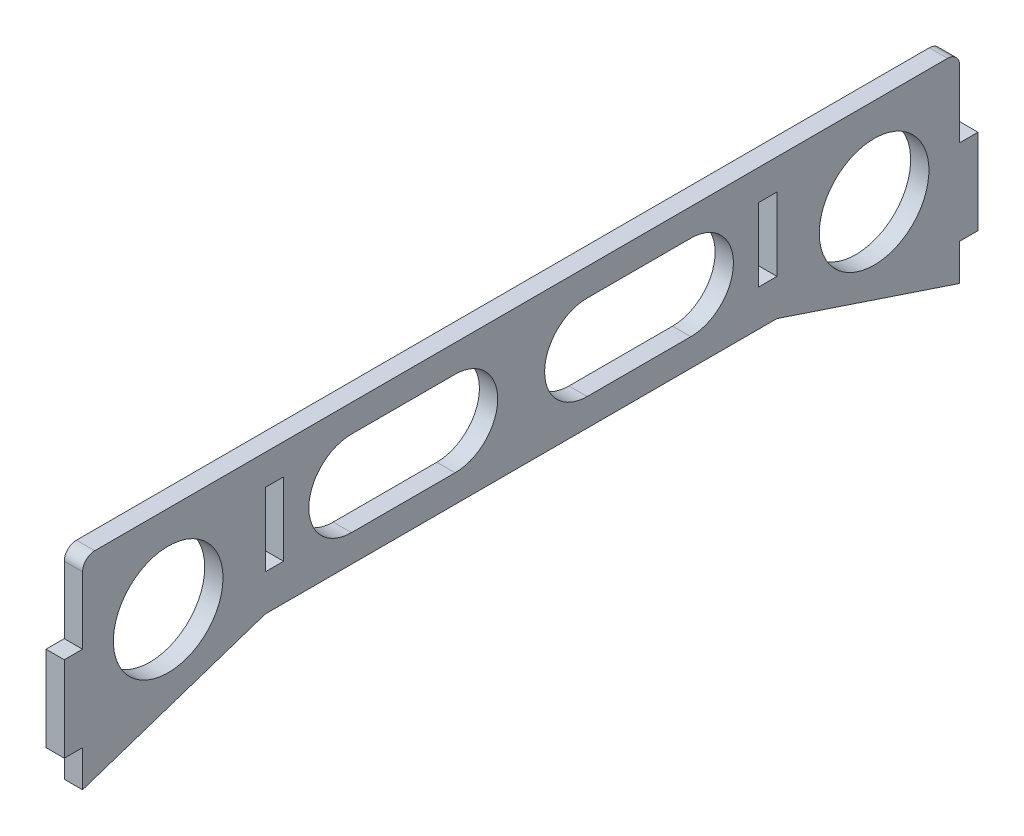
ISO-10303-21;
HEADER;
FILE_DESCRIPTION(('STEP AP214'),'2;1');
FILE_NAME('part.step','',(''),(''),'','','');
FILE_SCHEMA(('AUTOMOTIVE_DESIGN { 1 0 10303 214 1 1 1 1 }'));
ENDSEC;
DATA;
#1=APPLICATION_CONTEXT('core data for automotive mechanical design processes');
#2=APPLICATION_PROTOCOL_DEFINITION('international standard','automotive_design',2000,#1);
#3=PRODUCT_CONTEXT('',#1,'mechanical');
#4=PRODUCT('Part','Part','',(#3));
#5=PRODUCT_RELATED_PRODUCT_CATEGORY('part','',(#4));
#6=PRODUCT_DEFINITION_FORMATION('','',#4);
#7=PRODUCT_DEFINITION_CONTEXT('part definition',#1,'design');
#8=PRODUCT_DEFINITION('design','',#6,#7);
#9=PRODUCT_DEFINITION_SHAPE('','',#8);
#10=(LENGTH_UNIT() NAMED_UNIT(*) SI_UNIT(.MILLI.,.METRE.));
#11=(NAMED_UNIT(*) PLANE_ANGLE_UNIT() SI_UNIT($,.RADIAN.));
#12=(NAMED_UNIT(*) SI_UNIT($,.STERADIAN.) SOLID_ANGLE_UNIT());
#13=UNCERTAINTY_MEASURE_WITH_UNIT(LENGTH_MEASURE(1.E-05),#10,'distance_accuracy_value','');
#14=(GEOMETRIC_REPRESENTATION_CONTEXT(3) GLOBAL_UNCERTAINTY_ASSIGNED_CONTEXT((#13)) GLOBAL_UNIT_ASSIGNED_CONTEXT((#10,
#11,#12)) REPRESENTATION_CONTEXT('',''));
#15=CARTESIAN_POINT('',(0.,0.,0.));
#16=DIRECTION('',(0.,0.,1.));
#17=DIRECTION('',(1.,0.,0.));
#18=AXIS2_PLACEMENT_3D('',#15,#16,#17);
#19=CARTESIAN_POINT('',(3.,-11.5,-72.));
#20=DIRECTION('',(0.,0.,1.));
#21=DIRECTION('',(1.,0.,0.));
#22=AXIS2_PLACEMENT_3D('',#19,#20,#21);
#23=PLANE('',#22);
#24=DIRECTION('',(0.,1.,0.));
#25=VECTOR('',#24,1.);
#26=CARTESIAN_POINT('',(0.,-11.5,-72.));
#27=LINE('',#26,#25);
#28=CARTESIAN_POINT('',(0.,-21.5,-72.));
#29=VERTEX_POINT('',#28);
#30=CARTESIAN_POINT('',(0.,-15.5,-72.));
#31=VERTEX_POINT('',#30);
#32=EDGE_CURVE('E432',#29,#31,#27,.T.);
#33=ORIENTED_EDGE('',*,*,#32,.T.);
#34=DIRECTION('',(1.,0.,0.));
#35=VECTOR('',#34,1.);
#36=CARTESIAN_POINT('',(-14.3178210632764,-15.5,-72.));
#37=LINE('',#36,#35);
#38=CARTESIAN_POINT('',(3.,-15.5,-72.));
#39=VERTEX_POINT('',#38);
#40=EDGE_CURVE('E339',#31,#39,#37,.T.);
#41=ORIENTED_EDGE('',*,*,#40,.T.);
#42=DIRECTION('',(0.,1.,0.));
#43=VECTOR('',#42,1.);
#44=CARTESIAN_POINT('',(3.,-11.5,-72.));
#45=LINE('',#44,#43);
#46=CARTESIAN_POINT('',(3.,-21.5,-72.));
#47=VERTEX_POINT('',#46);
#48=EDGE_CURVE('E417',#47,#39,#45,.T.);
#49=ORIENTED_EDGE('',*,*,#48,.F.);
#50=DIRECTION('',(1.,0.,0.));
#51=VECTOR('',#50,1.);
#52=CARTESIAN_POINT('',(0.,-21.5,-72.));
#53=LINE('',#52,#51);
#54=EDGE_CURVE('E393',#29,#47,#53,.T.);
#55=ORIENTED_EDGE('',*,*,#54,.F.);
#56=EDGE_LOOP('',(#33,#41,#49,#55));
#57=FACE_BOUND('',#56,.T.);
#58=ADVANCED_FACE('F37',(#57),#23,.F.);
#59=CARTESIAN_POINT('',(3.,-11.5,72.));
#60=DIRECTION('',(0.,0.,-1.));
#61=DIRECTION('',(-1.,0.,0.));
#62=AXIS2_PLACEMENT_3D('',#59,#60,#61);
#63=PLANE('',#62);
#64=DIRECTION('',(0.,-1.,0.));
#65=VECTOR('',#64,1.);
#66=CARTESIAN_POINT('',(0.,-11.5,72.));
#67=LINE('',#66,#65);
#68=CARTESIAN_POINT('',(0.,9.5,72.));
#69=VERTEX_POINT('',#68);
#70=CARTESIAN_POINT('',(0.,-1.5,72.));
#71=VERTEX_POINT('',#70);
#72=EDGE_CURVE('E438',#69,#71,#67,.T.);
#73=ORIENTED_EDGE('',*,*,#72,.T.);
#74=DIRECTION('',(1.,0.,0.));
#75=VECTOR('',#74,1.);
#76=CARTESIAN_POINT('',(-14.3178210632764,-1.5,72.));
#77=LINE('',#76,#75);
#78=CARTESIAN_POINT('',(3.,-1.5,72.));
#79=VERTEX_POINT('',#78);
#80=EDGE_CURVE('E389',#71,#79,#77,.T.);
#81=ORIENTED_EDGE('',*,*,#80,.T.);
#82=DIRECTION('',(0.,-1.,0.));
#83=VECTOR('',#82,1.);
#84=CARTESIAN_POINT('',(3.,-11.5,72.));
#85=LINE('',#84,#83);
#86=CARTESIAN_POINT('',(3.,9.5,72.));
#87=VERTEX_POINT('',#86);
#88=EDGE_CURVE('E425',#87,#79,#85,.T.);
#89=ORIENTED_EDGE('',*,*,#88,.F.);
#90=DIRECTION('',(-1.,0.,0.));
#91=VECTOR('',#90,1.);
#92=CARTESIAN_POINT('',(3.,9.5,72.));
#93=LINE('',#92,#91);
#94=EDGE_CURVE('E458',#87,#69,#93,.T.);
#95=ORIENTED_EDGE('',*,*,#94,.T.);
#96=EDGE_LOOP('',(#73,#81,#89,#95));
#97=FACE_BOUND('',#96,.T.);
#98=ADVANCED_FACE('F537',(#97),#63,.F.);
#99=CARTESIAN_POINT('',(3.,-11.5,72.));
#100=DIRECTION('',(0.,1.,0.));
#101=DIRECTION('',(0.,0.,1.));
#102=AXIS2_PLACEMENT_3D('',#99,#100,#101);
#103=PLANE('',#102);
#104=DIRECTION('',(0.,0.,-1.));
#105=VECTOR('',#104,1.);
#106=CARTESIAN_POINT('',(0.,-11.5,72.));
#107=LINE('',#106,#105);
#108=CARTESIAN_POINT('',(0.,-11.5,42.));
#109=VERTEX_POINT('',#108);
#110=CARTESIAN_POINT('',(0.,-11.5,-42.));
#111=VERTEX_POINT('',#110);
#112=EDGE_CURVE('E440',#109,#111,#107,.T.);
#113=ORIENTED_EDGE('',*,*,#112,.T.);
#114=DIRECTION('',(1.,0.,0.));
#115=VECTOR('',#114,1.);
#116=CARTESIAN_POINT('',(0.,-11.5,-42.));
#117=LINE('',#116,#115);
#118=CARTESIAN_POINT('',(3.,-11.5,-42.));
#119=VERTEX_POINT('',#118);
#120=EDGE_CURVE('E394',#111,#119,#117,.T.);
#121=ORIENTED_EDGE('',*,*,#120,.T.);
#122=DIRECTION('',(0.,0.,-1.));
#123=VECTOR('',#122,1.);
#124=CARTESIAN_POINT('',(3.,-11.5,72.));
#125=LINE('',#124,#123);
#126=CARTESIAN_POINT('',(3.,-11.5,42.));
#127=VERTEX_POINT('',#126);
#128=EDGE_CURVE('E428',#127,#119,#125,.T.);
#129=ORIENTED_EDGE('',*,*,#128,.F.);
#130=DIRECTION('',(1.,0.,0.));
#131=VECTOR('',#130,1.);
#132=CARTESIAN_POINT('',(0.,-11.5,42.));
#133=LINE('',#132,#131);
#134=EDGE_CURVE('E411',#109,#127,#133,.T.);
#135=ORIENTED_EDGE('',*,*,#134,.F.);
#136=EDGE_LOOP('',(#113,#121,#129,#135));
#137=FACE_BOUND('',#136,.T.);
#138=ADVANCED_FACE('F544',(#137),#103,.F.);
#139=CARTESIAN_POINT('',(3.,-1.5,-72.));
#140=VERTEX_POINT('',#139);
#141=CARTESIAN_POINT('',(3.,9.5,-72.));
#142=VERTEX_POINT('',#141);
#143=EDGE_CURVE('E421',#140,#142,#45,.T.);
#144=ORIENTED_EDGE('',*,*,#143,.F.);
#145=DIRECTION('',(1.,0.,0.));
#146=VECTOR('',#145,1.);
#147=CARTESIAN_POINT('',(-14.3178210632764,-1.5,-72.));
#148=LINE('',#147,#146);
#149=CARTESIAN_POINT('',(0.,-1.5,-72.));
#150=VERTEX_POINT('',#149);
#151=EDGE_CURVE('E341',#150,#140,#148,.T.);
#152=ORIENTED_EDGE('',*,*,#151,.F.);
#153=CARTESIAN_POINT('',(0.,9.5,-72.));
#154=VERTEX_POINT('',#153);
#155=EDGE_CURVE('E414',#150,#154,#27,.T.);
#156=ORIENTED_EDGE('',*,*,#155,.T.);
#157=DIRECTION('',(-1.,0.,0.));
#158=VECTOR('',#157,1.);
#159=CARTESIAN_POINT('',(3.,9.5,-72.));
#160=LINE('',#159,#158);
#161=EDGE_CURVE('E451',#154,#142,#160,.F.);
#162=ORIENTED_EDGE('',*,*,#161,.T.);
#163=EDGE_LOOP('',(#144,#152,#156,#162));
#164=FACE_BOUND('',#163,.T.);
#165=ADVANCED_FACE('F540',(#164),#23,.F.);
#166=CARTESIAN_POINT('',(3.,11.5,72.));
#167=DIRECTION('',(0.,-1.,0.));
#168=DIRECTION('',(0.,0.,-1.));
#169=AXIS2_PLACEMENT_3D('',#166,#167,#168);
#170=PLANE('',#169);
#171=DIRECTION('',(0.,0.,1.));
#172=VECTOR('',#171,1.);
#173=CARTESIAN_POINT('',(3.,11.5,72.));
#174=LINE('',#173,#172);
#175=CARTESIAN_POINT('',(3.,11.5,-70.));
#176=VERTEX_POINT('',#175);
#177=CARTESIAN_POINT('',(3.,11.5,70.));
#178=VERTEX_POINT('',#177);
#179=EDGE_CURVE('E420',#176,#178,#174,.T.);
#180=ORIENTED_EDGE('',*,*,#179,.F.);
#181=DIRECTION('',(-1.,0.,0.));
#182=VECTOR('',#181,1.);
#183=CARTESIAN_POINT('',(3.,11.5,-70.));
#184=LINE('',#183,#182);
#185=CARTESIAN_POINT('',(0.,11.5,-70.));
#186=VERTEX_POINT('',#185);
#187=EDGE_CURVE('E443',#176,#186,#184,.T.);
#188=ORIENTED_EDGE('',*,*,#187,.T.);
#189=DIRECTION('',(0.,0.,1.));
#190=VECTOR('',#189,1.);
#191=CARTESIAN_POINT('',(0.,11.5,72.));
#192=LINE('',#191,#190);
#193=CARTESIAN_POINT('',(0.,11.5,70.));
#194=VERTEX_POINT('',#193);
#195=EDGE_CURVE('E434',#186,#194,#192,.T.);
#196=ORIENTED_EDGE('',*,*,#195,.T.);
#197=DIRECTION('',(-1.,0.,0.));
#198=VECTOR('',#197,1.);
#199=CARTESIAN_POINT('',(3.,11.5,70.));
#200=LINE('',#199,#198);
#201=EDGE_CURVE('E431',#194,#178,#200,.F.);
#202=ORIENTED_EDGE('',*,*,#201,.T.);
#203=EDGE_LOOP('',(#180,#188,#196,#202));
#204=FACE_BOUND('',#203,.T.);
#205=ADVANCED_FACE('F549',(#204),#170,.F.);
#206=CARTESIAN_POINT('',(3.,-15.5,72.));
#207=VERTEX_POINT('',#206);
#208=CARTESIAN_POINT('',(3.,-21.5,72.));
#209=VERTEX_POINT('',#208);
#210=EDGE_CURVE('E424',#207,#209,#85,.T.);
#211=ORIENTED_EDGE('',*,*,#210,.F.);
#212=DIRECTION('',(1.,0.,0.));
#213=VECTOR('',#212,1.);
#214=CARTESIAN_POINT('',(-14.3178210632764,-15.5,72.));
#215=LINE('',#214,#213);
#216=CARTESIAN_POINT('',(0.,-15.5,72.));
#217=VERTEX_POINT('',#216);
#218=EDGE_CURVE('E382',#217,#207,#215,.T.);
#219=ORIENTED_EDGE('',*,*,#218,.F.);
#220=CARTESIAN_POINT('',(0.,-21.5,72.));
#221=VERTEX_POINT('',#220);
#222=EDGE_CURVE('E437',#217,#221,#67,.T.);
#223=ORIENTED_EDGE('',*,*,#222,.T.);
#224=DIRECTION('',(1.,0.,0.));
#225=VECTOR('',#224,1.);
#226=CARTESIAN_POINT('',(0.,-21.5,72.));
#227=LINE('',#226,#225);
#228=EDGE_CURVE('E408',#221,#209,#227,.T.);
#229=ORIENTED_EDGE('',*,*,#228,.T.);
#230=EDGE_LOOP('',(#211,#219,#223,#229));
#231=FACE_BOUND('',#230,.T.);
#232=ADVANCED_FACE('F516',(#231),#63,.F.);
#233=CARTESIAN_POINT('',(3.,0.,0.));
#234=DIRECTION('',(-1.,0.,0.));
#235=DIRECTION('',(0.,0.,1.));
#236=AXIS2_PLACEMENT_3D('',#233,#234,#235);
#237=PLANE('',#236);
#238=CARTESIAN_POINT('',(3.,-2.87525013636264,-57.9425030381103));
#239=DIRECTION('',(1.,0.,0.));
#240=DIRECTION('',(0.,0.,1.));
#241=AXIS2_PLACEMENT_3D('',#238,#239,#240);
#242=CIRCLE('',#241,9.);
#243=CARTESIAN_POINT('',(3.,-2.87525013636264,-48.9425030381103));
#244=VERTEX_POINT('',#243);
#245=EDGE_CURVE('E289',#244,#244,#242,.T.);
#246=ORIENTED_EDGE('',*,*,#245,.F.);
#247=EDGE_LOOP('',(#246));
#248=FACE_BOUND('',#247,.T.);
#249=DIRECTION('',(0.,0.,1.));
#250=VECTOR('',#249,1.);
#251=CARTESIAN_POINT('',(3.,6.5,-42.));
#252=LINE('',#251,#250);
#253=CARTESIAN_POINT('',(3.,6.5,-42.));
#254=VERTEX_POINT('',#253);
#255=CARTESIAN_POINT('',(3.,6.5,-39.));
#256=VERTEX_POINT('',#255);
#257=EDGE_CURVE('E312',#254,#256,#252,.T.);
#258=ORIENTED_EDGE('',*,*,#257,.F.);
#259=DIRECTION('',(0.,1.,0.));
#260=VECTOR('',#259,1.);
#261=CARTESIAN_POINT('',(3.,6.5,-42.));
#262=LINE('',#261,#260);
#263=CARTESIAN_POINT('',(3.,-5.5,-42.));
#264=VERTEX_POINT('',#263);
#265=EDGE_CURVE('E53',#264,#254,#262,.T.);
#266=ORIENTED_EDGE('',*,*,#265,.F.);
#267=DIRECTION('',(0.,0.,-1.));
#268=VECTOR('',#267,1.);
#269=CARTESIAN_POINT('',(3.,-5.5,-42.));
#270=LINE('',#269,#268);
#271=CARTESIAN_POINT('',(3.,-5.5,-39.));
#272=VERTEX_POINT('',#271);
#273=EDGE_CURVE('E301',#272,#264,#270,.T.);
#274=ORIENTED_EDGE('',*,*,#273,.F.);
#275=DIRECTION('',(0.,-1.,0.));
#276=VECTOR('',#275,1.);
#277=CARTESIAN_POINT('',(3.,6.5,-39.));
#278=LINE('',#277,#276);
#279=EDGE_CURVE('E309',#256,#272,#278,.T.);
#280=ORIENTED_EDGE('',*,*,#279,.F.);
#281=EDGE_LOOP('',(#258,#266,#274,#280));
#282=FACE_BOUND('',#281,.T.);
#283=CARTESIAN_POINT('',(3.,-2.87525013636264,57.9425030381103));
#284=DIRECTION('',(1.,0.,0.));
#285=DIRECTION('',(0.,0.,-1.));
#286=AXIS2_PLACEMENT_3D('',#283,#284,#285);
#287=CIRCLE('',#286,9.);
#288=CARTESIAN_POINT('',(3.,-2.87525013636264,48.9425030381103));
#289=VERTEX_POINT('',#288);
#290=EDGE_CURVE('E271',#289,#289,#287,.T.);
#291=ORIENTED_EDGE('',*,*,#290,.F.);
#292=EDGE_LOOP('',(#291));
#293=FACE_BOUND('',#292,.T.);
#294=DIRECTION('',(0.,0.,-1.));
#295=VECTOR('',#294,1.);
#296=CARTESIAN_POINT('',(3.,-7.,27.8514509152463));
#297=LINE('',#296,#295);
#298=CARTESIAN_POINT('',(3.,-7.,27.8514509152463));
#299=VERTEX_POINT('',#298);
#300=CARTESIAN_POINT('',(3.,-7.,10.8514509152463));
#301=VERTEX_POINT('',#300);
#302=EDGE_CURVE('E270',#299,#301,#297,.T.);
#303=ORIENTED_EDGE('',*,*,#302,.F.);
#304=CARTESIAN_POINT('',(3.,0.,27.8514509152463));
#305=DIRECTION('',(1.,0.,0.));
#306=DIRECTION('',(0.,0.,-1.));
#307=AXIS2_PLACEMENT_3D('',#304,#305,#306);
#308=CIRCLE('',#307,7.);
#309=CARTESIAN_POINT('',(3.,7.,27.8514509152463));
#310=VERTEX_POINT('',#309);
#311=EDGE_CURVE('E61',#310,#299,#308,.T.);
#312=ORIENTED_EDGE('',*,*,#311,.F.);
#313=DIRECTION('',(0.,0.,1.));
#314=VECTOR('',#313,1.);
#315=CARTESIAN_POINT('',(3.,7.,27.8514509152463));
#316=LINE('',#315,#314);
#317=CARTESIAN_POINT('',(3.,7.,10.8514509152463));
#318=VERTEX_POINT('',#317);
#319=EDGE_CURVE('E257',#318,#310,#316,.T.);
#320=ORIENTED_EDGE('',*,*,#319,.F.);
#321=CARTESIAN_POINT('',(3.,0.,10.8514509152463));
#322=DIRECTION('',(1.,0.,0.));
#323=DIRECTION('',(0.,0.,-1.));
#324=AXIS2_PLACEMENT_3D('',#321,#322,#323);
#325=CIRCLE('',#324,7.);
#326=EDGE_CURVE('E263',#301,#318,#325,.T.);
#327=ORIENTED_EDGE('',*,*,#326,.F.);
#328=EDGE_LOOP('',(#303,#312,#320,#327));
#329=FACE_BOUND('',#328,.T.);
#330=DIRECTION('',(0.,0.,1.));
#331=VECTOR('',#330,1.);
#332=CARTESIAN_POINT('',(3.,7.,-27.8514509152463));
#333=LINE('',#332,#331);
#334=CARTESIAN_POINT('',(3.,7.,-27.8514509152463));
#335=VERTEX_POINT('',#334);
#336=CARTESIAN_POINT('',(3.,7.,-10.8514509152463));
#337=VERTEX_POINT('',#336);
#338=EDGE_CURVE('E295',#335,#337,#333,.T.);
#339=ORIENTED_EDGE('',*,*,#338,.F.);
#340=CARTESIAN_POINT('',(3.,0.,-27.8514509152463));
#341=DIRECTION('',(1.,0.,0.));
#342=DIRECTION('',(0.,0.,1.));
#343=AXIS2_PLACEMENT_3D('',#340,#341,#342);
#344=CIRCLE('',#343,7.);
#345=CARTESIAN_POINT('',(3.,-7.,-27.8514509152463));
#346=VERTEX_POINT('',#345);
#347=EDGE_CURVE('E254',#346,#335,#344,.T.);
#348=ORIENTED_EDGE('',*,*,#347,.F.);
#349=DIRECTION('',(0.,0.,-1.));
#350=VECTOR('',#349,1.);
#351=CARTESIAN_POINT('',(3.,-7.,-27.8514509152463));
#352=LINE('',#351,#350);
#353=CARTESIAN_POINT('',(3.,-7.,-10.8514509152463));
#354=VERTEX_POINT('',#353);
#355=EDGE_CURVE('E282',#354,#346,#352,.T.);
#356=ORIENTED_EDGE('',*,*,#355,.F.);
#357=CARTESIAN_POINT('',(3.,0.,-10.8514509152463));
#358=DIRECTION('',(1.,0.,0.));
#359=DIRECTION('',(0.,0.,1.));
#360=AXIS2_PLACEMENT_3D('',#357,#358,#359);
#361=CIRCLE('',#360,7.);
#362=EDGE_CURVE('E292',#337,#354,#361,.T.);
#363=ORIENTED_EDGE('',*,*,#362,.F.);
#364=EDGE_LOOP('',(#339,#348,#356,#363));
#365=FACE_BOUND('',#364,.T.);
#366=DIRECTION('',(0.,0.,-1.));
#367=VECTOR('',#366,1.);
#368=CARTESIAN_POINT('',(3.,-5.5,42.));
#369=LINE('',#368,#367);
#370=CARTESIAN_POINT('',(3.,-5.5,42.));
#371=VERTEX_POINT('',#370);
#372=CARTESIAN_POINT('',(3.,-5.5,39.));
#373=VERTEX_POINT('',#372);
#374=EDGE_CURVE('E320',#371,#373,#369,.T.);
#375=ORIENTED_EDGE('',*,*,#374,.F.);
#376=DIRECTION('',(0.,-1.,0.));
#377=VECTOR('',#376,1.);
#378=CARTESIAN_POINT('',(3.,6.5,42.));
#379=LINE('',#378,#377);
#380=CARTESIAN_POINT('',(3.,6.5,42.));
#381=VERTEX_POINT('',#380);
#382=EDGE_CURVE('E315',#381,#371,#379,.T.);
#383=ORIENTED_EDGE('',*,*,#382,.F.);
#384=DIRECTION('',(0.,0.,1.));
#385=VECTOR('',#384,1.);
#386=CARTESIAN_POINT('',(3.,6.5,42.));
#387=LINE('',#386,#385);
#388=CARTESIAN_POINT('',(3.,6.5,39.));
#389=VERTEX_POINT('',#388);
#390=EDGE_CURVE('E326',#389,#381,#387,.T.);
#391=ORIENTED_EDGE('',*,*,#390,.F.);
#392=DIRECTION('',(0.,1.,0.));
#393=VECTOR('',#392,1.);
#394=CARTESIAN_POINT('',(3.,6.5,39.));
#395=LINE('',#394,#393);
#396=EDGE_CURVE('E323',#373,#389,#395,.T.);
#397=ORIENTED_EDGE('',*,*,#396,.F.);
#398=EDGE_LOOP('',(#375,#383,#391,#397));
#399=FACE_BOUND('',#398,.T.);
#400=ORIENTED_EDGE('',*,*,#48,.T.);
#401=DIRECTION('',(0.,0.,-1.));
#402=VECTOR('',#401,1.);
#403=CARTESIAN_POINT('',(3.,-15.5,-72.));
#404=LINE('',#403,#402);
#405=CARTESIAN_POINT('',(3.,-15.5,-75.));
#406=VERTEX_POINT('',#405);
#407=EDGE_CURVE('E358',#39,#406,#404,.T.);
#408=ORIENTED_EDGE('',*,*,#407,.T.);
#409=DIRECTION('',(0.,1.,0.));
#410=VECTOR('',#409,1.);
#411=CARTESIAN_POINT('',(3.,-1.5,-75.));
#412=LINE('',#411,#410);
#413=CARTESIAN_POINT('',(3.,-1.5,-75.));
#414=VERTEX_POINT('',#413);
#415=EDGE_CURVE('E362',#406,#414,#412,.T.);
#416=ORIENTED_EDGE('',*,*,#415,.T.);
#417=DIRECTION('',(0.,0.,1.));
#418=VECTOR('',#417,1.);
#419=CARTESIAN_POINT('',(3.,-1.5,-72.));
#420=LINE('',#419,#418);
#421=EDGE_CURVE('E357',#414,#140,#420,.T.);
#422=ORIENTED_EDGE('',*,*,#421,.T.);
#423=ORIENTED_EDGE('',*,*,#143,.T.);
#424=CARTESIAN_POINT('',(3.,9.5,-70.));
#425=DIRECTION('',(-1.,0.,0.));
#426=DIRECTION('',(0.,0.,1.));
#427=AXIS2_PLACEMENT_3D('',#424,#425,#426);
#428=CIRCLE('',#427,2.);
#429=EDGE_CURVE('E456',#142,#176,#428,.F.);
#430=ORIENTED_EDGE('',*,*,#429,.T.);
#431=ORIENTED_EDGE('',*,*,#179,.T.);
#432=CARTESIAN_POINT('',(3.,9.5,70.));
#433=DIRECTION('',(-1.,0.,0.));
#434=DIRECTION('',(0.,0.,1.));
#435=AXIS2_PLACEMENT_3D('',#432,#433,#434);
#436=CIRCLE('',#435,2.);
#437=EDGE_CURVE('E454',#178,#87,#436,.F.);
#438=ORIENTED_EDGE('',*,*,#437,.T.);
#439=ORIENTED_EDGE('',*,*,#88,.T.);
#440=DIRECTION('',(0.,0.,1.));
#441=VECTOR('',#440,1.);
#442=CARTESIAN_POINT('',(3.,-1.5,72.));
#443=LINE('',#442,#441);
#444=CARTESIAN_POINT('',(3.,-1.5,75.));
#445=VERTEX_POINT('',#444);
#446=EDGE_CURVE('E361',#79,#445,#443,.T.);
#447=ORIENTED_EDGE('',*,*,#446,.T.);
#448=DIRECTION('',(0.,-1.,0.));
#449=VECTOR('',#448,1.);
#450=CARTESIAN_POINT('',(3.,-1.5,75.));
#451=LINE('',#450,#449);
#452=CARTESIAN_POINT('',(3.,-15.5,75.));
#453=VERTEX_POINT('',#452);
#454=EDGE_CURVE('E371',#445,#453,#451,.T.);
#455=ORIENTED_EDGE('',*,*,#454,.T.);
#456=DIRECTION('',(0.,0.,-1.));
#457=VECTOR('',#456,1.);
#458=CARTESIAN_POINT('',(3.,-15.5,72.));
#459=LINE('',#458,#457);
#460=EDGE_CURVE('E367',#453,#207,#459,.T.);
#461=ORIENTED_EDGE('',*,*,#460,.T.);
#462=ORIENTED_EDGE('',*,*,#210,.T.);
#463=DIRECTION('',(0.,0.316227766016838,-0.948683298050514));
#464=VECTOR('',#463,1.);
#465=CARTESIAN_POINT('',(3.,-21.5,72.));
#466=LINE('',#465,#464);
#467=EDGE_CURVE('E402',#209,#127,#466,.T.);
#468=ORIENTED_EDGE('',*,*,#467,.T.);
#469=ORIENTED_EDGE('',*,*,#128,.T.);
#470=DIRECTION('',(0.,-0.316227766016838,-0.948683298050514));
#471=VECTOR('',#470,1.);
#472=CARTESIAN_POINT('',(3.,-21.5,-72.));
#473=LINE('',#472,#471);
#474=EDGE_CURVE('E399',#119,#47,#473,.T.);
#475=ORIENTED_EDGE('',*,*,#474,.T.);
#476=EDGE_LOOP('',(#400,#408,#416,#422,#423,#430,#431,#438,#439,#447,#455,#461,#462,#468,#469,#475));
#477=FACE_BOUND('',#476,.T.);
#478=ADVANCED_FACE('F267',(#248,#282,#293,#329,#365,#399,#477),#237,.F.);
#479=CARTESIAN_POINT('',(0.,0.,0.));
#480=DIRECTION('',(-1.,0.,0.));
#481=DIRECTION('',(0.,0.,1.));
#482=AXIS2_PLACEMENT_3D('',#479,#480,#481);
#483=PLANE('',#482);
#484=CARTESIAN_POINT('',(0.,-2.87525013636264,-57.9425030381103));
#485=DIRECTION('',(-1.,0.,0.));
#486=DIRECTION('',(0.,0.,1.));
#487=AXIS2_PLACEMENT_3D('',#484,#485,#486);
#488=CIRCLE('',#487,9.);
#489=CARTESIAN_POINT('',(0.,-2.87525013636264,-48.9425030381103));
#490=VERTEX_POINT('',#489);
#491=EDGE_CURVE('E41',#490,#490,#488,.T.);
#492=ORIENTED_EDGE('',*,*,#491,.F.);
#493=EDGE_LOOP('',(#492));
#494=FACE_BOUND('',#493,.T.);
#495=DIRECTION('',(0.,-1.,0.));
#496=VECTOR('',#495,1.);
#497=CARTESIAN_POINT('',(0.,0.,-42.));
#498=LINE('',#497,#496);
#499=CARTESIAN_POINT('',(0.,6.5,-42.));
#500=VERTEX_POINT('',#499);
#501=CARTESIAN_POINT('',(0.,-5.5,-42.));
#502=VERTEX_POINT('',#501);
#503=EDGE_CURVE('E11',#500,#502,#498,.T.);
#504=ORIENTED_EDGE('',*,*,#503,.F.);
#505=DIRECTION('',(0.,0.,-1.));
#506=VECTOR('',#505,1.);
#507=CARTESIAN_POINT('',(0.,6.5,0.));
#508=LINE('',#507,#506);
#509=CARTESIAN_POINT('',(0.,6.5,-39.));
#510=VERTEX_POINT('',#509);
#511=EDGE_CURVE('E487',#510,#500,#508,.T.);
#512=ORIENTED_EDGE('',*,*,#511,.F.);
#513=DIRECTION('',(0.,1.,0.));
#514=VECTOR('',#513,1.);
#515=CARTESIAN_POINT('',(0.,0.,-39.));
#516=LINE('',#515,#514);
#517=CARTESIAN_POINT('',(0.,-5.5,-39.));
#518=VERTEX_POINT('',#517);
#519=EDGE_CURVE('E491',#518,#510,#516,.T.);
#520=ORIENTED_EDGE('',*,*,#519,.F.);
#521=DIRECTION('',(0.,0.,1.));
#522=VECTOR('',#521,1.);
#523=CARTESIAN_POINT('',(0.,-5.5,0.));
#524=LINE('',#523,#522);
#525=EDGE_CURVE('E46',#502,#518,#524,.T.);
#526=ORIENTED_EDGE('',*,*,#525,.F.);
#527=EDGE_LOOP('',(#504,#512,#520,#526));
#528=FACE_BOUND('',#527,.T.);
#529=CARTESIAN_POINT('',(0.,-2.87525013636264,57.9425030381103));
#530=DIRECTION('',(-1.,0.,0.));
#531=DIRECTION('',(0.,0.,1.));
#532=AXIS2_PLACEMENT_3D('',#529,#530,#531);
#533=CIRCLE('',#532,9.);
#534=CARTESIAN_POINT('',(0.,-2.87525013636264,66.9425030381103));
#535=VERTEX_POINT('',#534);
#536=EDGE_CURVE('E332',#535,#535,#533,.T.);
#537=ORIENTED_EDGE('',*,*,#536,.F.);
#538=EDGE_LOOP('',(#537));
#539=FACE_BOUND('',#538,.T.);
#540=CARTESIAN_POINT('',(0.,0.,27.8514509152463));
#541=DIRECTION('',(-1.,0.,0.));
#542=DIRECTION('',(0.,0.,1.));
#543=AXIS2_PLACEMENT_3D('',#540,#541,#542);
#544=CIRCLE('',#543,7.);
#545=CARTESIAN_POINT('',(0.,-7.,27.8514509152463));
#546=VERTEX_POINT('',#545);
#547=CARTESIAN_POINT('',(0.,7.,27.8514509152463));
#548=VERTEX_POINT('',#547);
#549=EDGE_CURVE('E250',#546,#548,#544,.T.);
#550=ORIENTED_EDGE('',*,*,#549,.F.);
#551=DIRECTION('',(0.,0.,1.));
#552=VECTOR('',#551,1.);
#553=CARTESIAN_POINT('',(0.,-7.,0.));
#554=LINE('',#553,#552);
#555=CARTESIAN_POINT('',(0.,-7.,10.8514509152463));
#556=VERTEX_POINT('',#555);
#557=EDGE_CURVE('E479',#556,#546,#554,.T.);
#558=ORIENTED_EDGE('',*,*,#557,.F.);
#559=CARTESIAN_POINT('',(0.,0.,10.8514509152463));
#560=DIRECTION('',(-1.,0.,0.));
#561=DIRECTION('',(0.,0.,1.));
#562=AXIS2_PLACEMENT_3D('',#559,#560,#561);
#563=CIRCLE('',#562,7.);
#564=CARTESIAN_POINT('',(0.,7.,10.8514509152463));
#565=VERTEX_POINT('',#564);
#566=EDGE_CURVE('E481',#565,#556,#563,.T.);
#567=ORIENTED_EDGE('',*,*,#566,.F.);
#568=DIRECTION('',(0.,0.,-1.));
#569=VECTOR('',#568,1.);
#570=CARTESIAN_POINT('',(0.,7.,0.));
#571=LINE('',#570,#569);
#572=EDGE_CURVE('E484',#548,#565,#571,.T.);
#573=ORIENTED_EDGE('',*,*,#572,.F.);
#574=EDGE_LOOP('',(#550,#558,#567,#573));
#575=FACE_BOUND('',#574,.T.);
#576=CARTESIAN_POINT('',(0.,0.,-27.8514509152463));
#577=DIRECTION('',(-1.,0.,0.));
#578=DIRECTION('',(0.,0.,1.));
#579=AXIS2_PLACEMENT_3D('',#576,#577,#578);
#580=CIRCLE('',#579,7.);
#581=CARTESIAN_POINT('',(0.,7.,-27.8514509152463));
#582=VERTEX_POINT('',#581);
#583=CARTESIAN_POINT('',(0.,-7.,-27.8514509152463));
#584=VERTEX_POINT('',#583);
#585=EDGE_CURVE('E477',#582,#584,#580,.T.);
#586=ORIENTED_EDGE('',*,*,#585,.F.);
#587=DIRECTION('',(0.,0.,-1.));
#588=VECTOR('',#587,1.);
#589=CARTESIAN_POINT('',(0.,7.,0.));
#590=LINE('',#589,#588);
#591=CARTESIAN_POINT('',(0.,7.,-10.8514509152463));
#592=VERTEX_POINT('',#591);
#593=EDGE_CURVE('E470',#592,#582,#590,.T.);
#594=ORIENTED_EDGE('',*,*,#593,.F.);
#595=CARTESIAN_POINT('',(0.,0.,-10.8514509152463));
#596=DIRECTION('',(-1.,0.,0.));
#597=DIRECTION('',(0.,0.,1.));
#598=AXIS2_PLACEMENT_3D('',#595,#596,#597);
#599=CIRCLE('',#598,7.);
#600=CARTESIAN_POINT('',(0.,-7.,-10.8514509152463));
#601=VERTEX_POINT('',#600);
#602=EDGE_CURVE('E472',#601,#592,#599,.T.);
#603=ORIENTED_EDGE('',*,*,#602,.F.);
#604=DIRECTION('',(0.,0.,1.));
#605=VECTOR('',#604,1.);
#606=CARTESIAN_POINT('',(0.,-7.,0.));
#607=LINE('',#606,#605);
#608=EDGE_CURVE('E475',#584,#601,#607,.T.);
#609=ORIENTED_EDGE('',*,*,#608,.F.);
#610=EDGE_LOOP('',(#586,#594,#603,#609));
#611=FACE_BOUND('',#610,.T.);
#612=DIRECTION('',(0.,1.,0.));
#613=VECTOR('',#612,1.);
#614=CARTESIAN_POINT('',(0.,0.,42.));
#615=LINE('',#614,#613);
#616=CARTESIAN_POINT('',(0.,-5.5,42.));
#617=VERTEX_POINT('',#616);
#618=CARTESIAN_POINT('',(0.,6.5,42.));
#619=VERTEX_POINT('',#618);
#620=EDGE_CURVE('E468',#617,#619,#615,.T.);
#621=ORIENTED_EDGE('',*,*,#620,.F.);
#622=DIRECTION('',(0.,0.,1.));
#623=VECTOR('',#622,1.);
#624=CARTESIAN_POINT('',(0.,-5.5,0.));
#625=LINE('',#624,#623);
#626=CARTESIAN_POINT('',(0.,-5.5,39.));
#627=VERTEX_POINT('',#626);
#628=EDGE_CURVE('E461',#627,#617,#625,.T.);
#629=ORIENTED_EDGE('',*,*,#628,.F.);
#630=DIRECTION('',(0.,-1.,0.));
#631=VECTOR('',#630,1.);
#632=CARTESIAN_POINT('',(0.,0.,39.));
#633=LINE('',#632,#631);
#634=CARTESIAN_POINT('',(0.,6.5,39.));
#635=VERTEX_POINT('',#634);
#636=EDGE_CURVE('E463',#635,#627,#633,.T.);
#637=ORIENTED_EDGE('',*,*,#636,.F.);
#638=DIRECTION('',(0.,0.,-1.));
#639=VECTOR('',#638,1.);
#640=CARTESIAN_POINT('',(0.,6.5,0.));
#641=LINE('',#640,#639);
#642=EDGE_CURVE('E466',#619,#635,#641,.T.);
#643=ORIENTED_EDGE('',*,*,#642,.F.);
#644=EDGE_LOOP('',(#621,#629,#637,#643));
#645=FACE_BOUND('',#644,.T.);
#646=ORIENTED_EDGE('',*,*,#195,.F.);
#647=CARTESIAN_POINT('',(0.,9.5,-70.));
#648=DIRECTION('',(-1.,0.,0.));
#649=DIRECTION('',(0.,0.,1.));
#650=AXIS2_PLACEMENT_3D('',#647,#648,#649);
#651=CIRCLE('',#650,2.);
#652=EDGE_CURVE('E448',#186,#154,#651,.T.);
#653=ORIENTED_EDGE('',*,*,#652,.T.);
#654=ORIENTED_EDGE('',*,*,#155,.F.);
#655=DIRECTION('',(0.,0.,1.));
#656=VECTOR('',#655,1.);
#657=CARTESIAN_POINT('',(0.,-1.5,-72.));
#658=LINE('',#657,#656);
#659=CARTESIAN_POINT('',(0.,-1.5,-75.));
#660=VERTEX_POINT('',#659);
#661=EDGE_CURVE('E348',#660,#150,#658,.T.);
#662=ORIENTED_EDGE('',*,*,#661,.F.);
#663=DIRECTION('',(0.,1.,0.));
#664=VECTOR('',#663,1.);
#665=CARTESIAN_POINT('',(0.,-1.5,-75.));
#666=LINE('',#665,#664);
#667=CARTESIAN_POINT('',(0.,-15.5,-75.));
#668=VERTEX_POINT('',#667);
#669=EDGE_CURVE('E345',#668,#660,#666,.T.);
#670=ORIENTED_EDGE('',*,*,#669,.F.);
#671=DIRECTION('',(0.,0.,-1.));
#672=VECTOR('',#671,1.);
#673=CARTESIAN_POINT('',(0.,-15.5,-72.));
#674=LINE('',#673,#672);
#675=EDGE_CURVE('E344',#31,#668,#674,.T.);
#676=ORIENTED_EDGE('',*,*,#675,.F.);
#677=ORIENTED_EDGE('',*,*,#32,.F.);
#678=DIRECTION('',(0.,-0.316227766016838,-0.948683298050514));
#679=VECTOR('',#678,1.);
#680=CARTESIAN_POINT('',(0.,-21.5,-72.));
#681=LINE('',#680,#679);
#682=EDGE_CURVE('E396',#111,#29,#681,.T.);
#683=ORIENTED_EDGE('',*,*,#682,.F.);
#684=ORIENTED_EDGE('',*,*,#112,.F.);
#685=DIRECTION('',(0.,0.316227766016838,-0.948683298050514));
#686=VECTOR('',#685,1.);
#687=CARTESIAN_POINT('',(0.,-21.5,72.));
#688=LINE('',#687,#686);
#689=EDGE_CURVE('E405',#221,#109,#688,.T.);
#690=ORIENTED_EDGE('',*,*,#689,.F.);
#691=ORIENTED_EDGE('',*,*,#222,.F.);
#692=DIRECTION('',(0.,0.,-1.));
#693=VECTOR('',#692,1.);
#694=CARTESIAN_POINT('',(0.,-15.5,72.));
#695=LINE('',#694,#693);
#696=CARTESIAN_POINT('',(0.,-15.5,75.));
#697=VERTEX_POINT('',#696);
#698=EDGE_CURVE('E379',#697,#217,#695,.T.);
#699=ORIENTED_EDGE('',*,*,#698,.F.);
#700=DIRECTION('',(0.,-1.,0.));
#701=VECTOR('',#700,1.);
#702=CARTESIAN_POINT('',(0.,-1.5,75.));
#703=LINE('',#702,#701);
#704=CARTESIAN_POINT('',(0.,-1.5,75.));
#705=VERTEX_POINT('',#704);
#706=EDGE_CURVE('E384',#705,#697,#703,.T.);
#707=ORIENTED_EDGE('',*,*,#706,.F.);
#708=DIRECTION('',(0.,0.,1.));
#709=VECTOR('',#708,1.);
#710=CARTESIAN_POINT('',(0.,-1.5,72.));
#711=LINE('',#710,#709);
#712=EDGE_CURVE('E370',#71,#705,#711,.T.);
#713=ORIENTED_EDGE('',*,*,#712,.F.);
#714=ORIENTED_EDGE('',*,*,#72,.F.);
#715=CARTESIAN_POINT('',(0.,9.5,70.));
#716=DIRECTION('',(-1.,0.,0.));
#717=DIRECTION('',(0.,0.,1.));
#718=AXIS2_PLACEMENT_3D('',#715,#716,#717);
#719=CIRCLE('',#718,2.);
#720=EDGE_CURVE('E446',#69,#194,#719,.T.);
#721=ORIENTED_EDGE('',*,*,#720,.T.);
#722=EDGE_LOOP('',(#646,#653,#654,#662,#670,#676,#677,#683,#684,#690,#691,#699,#707,#713,#714,#721));
#723=FACE_BOUND('',#722,.T.);
#724=ADVANCED_FACE('F507',(#494,#528,#539,#575,#611,#645,#723),#483,.T.);
#725=CARTESIAN_POINT('',(3.,9.5,-70.));
#726=DIRECTION('',(-1.,0.,0.));
#727=DIRECTION('',(0.,0.,1.));
#728=AXIS2_PLACEMENT_3D('',#725,#726,#727);
#729=CYLINDRICAL_SURFACE('',#728,2.);
#730=ORIENTED_EDGE('',*,*,#429,.F.);
#731=ORIENTED_EDGE('',*,*,#161,.F.);
#732=ORIENTED_EDGE('',*,*,#652,.F.);
#733=ORIENTED_EDGE('',*,*,#187,.F.);
#734=EDGE_LOOP('',(#730,#731,#732,#733));
#735=FACE_BOUND('',#734,.T.);
#736=ADVANCED_FACE('F577',(#735),#729,.T.);
#737=CARTESIAN_POINT('',(3.,9.5,70.));
#738=DIRECTION('',(-1.,0.,0.));
#739=DIRECTION('',(0.,0.,1.));
#740=AXIS2_PLACEMENT_3D('',#737,#738,#739);
#741=CYLINDRICAL_SURFACE('',#740,2.);
#742=ORIENTED_EDGE('',*,*,#437,.F.);
#743=ORIENTED_EDGE('',*,*,#201,.F.);
#744=ORIENTED_EDGE('',*,*,#720,.F.);
#745=ORIENTED_EDGE('',*,*,#94,.F.);
#746=EDGE_LOOP('',(#742,#743,#744,#745));
#747=FACE_BOUND('',#746,.T.);
#748=ADVANCED_FACE('F39',(#747),#741,.T.);
#749=CARTESIAN_POINT('',(0.,-21.5,72.));
#750=DIRECTION('',(0.,-0.948683298050514,-0.316227766016838));
#751=DIRECTION('',(0.,0.316227766016838,-0.948683298050514));
#752=AXIS2_PLACEMENT_3D('',#749,#750,#751);
#753=PLANE('',#752);
#754=ORIENTED_EDGE('',*,*,#467,.F.);
#755=ORIENTED_EDGE('',*,*,#228,.F.);
#756=ORIENTED_EDGE('',*,*,#689,.T.);
#757=ORIENTED_EDGE('',*,*,#134,.T.);
#758=EDGE_LOOP('',(#754,#755,#756,#757));
#759=FACE_BOUND('',#758,.T.);
#760=ADVANCED_FACE('F603',(#759),#753,.T.);
#761=CARTESIAN_POINT('',(0.,-21.5,-72.));
#762=DIRECTION('',(0.,-0.948683298050514,0.316227766016838));
#763=DIRECTION('',(0.,-0.316227766016838,-0.948683298050514));
#764=AXIS2_PLACEMENT_3D('',#761,#762,#763);
#765=PLANE('',#764);
#766=ORIENTED_EDGE('',*,*,#474,.F.);
#767=ORIENTED_EDGE('',*,*,#120,.F.);
#768=ORIENTED_EDGE('',*,*,#682,.T.);
#769=ORIENTED_EDGE('',*,*,#54,.T.);
#770=EDGE_LOOP('',(#766,#767,#768,#769));
#771=FACE_BOUND('',#770,.T.);
#772=ADVANCED_FACE('F610',(#771),#765,.T.);
#773=CARTESIAN_POINT('',(-14.3178210632764,-1.5,72.));
#774=DIRECTION('',(0.,1.,0.));
#775=DIRECTION('',(0.,0.,1.));
#776=AXIS2_PLACEMENT_3D('',#773,#774,#775);
#777=PLANE('',#776);
#778=ORIENTED_EDGE('',*,*,#80,.F.);
#779=ORIENTED_EDGE('',*,*,#712,.T.);
#780=DIRECTION('',(1.,0.,0.));
#781=VECTOR('',#780,1.);
#782=CARTESIAN_POINT('',(-14.3178210632764,-1.5,75.));
#783=LINE('',#782,#781);
#784=EDGE_CURVE('E378',#705,#445,#783,.T.);
#785=ORIENTED_EDGE('',*,*,#784,.T.);
#786=ORIENTED_EDGE('',*,*,#446,.F.);
#787=EDGE_LOOP('',(#778,#779,#785,#786));
#788=FACE_BOUND('',#787,.T.);
#789=ADVANCED_FACE('F589',(#788),#777,.T.);
#790=CARTESIAN_POINT('',(-14.3178210632764,-1.5,75.));
#791=DIRECTION('',(0.,0.,1.));
#792=DIRECTION('',(1.,0.,0.));
#793=AXIS2_PLACEMENT_3D('',#790,#791,#792);
#794=PLANE('',#793);
#795=ORIENTED_EDGE('',*,*,#784,.F.);
#796=ORIENTED_EDGE('',*,*,#706,.T.);
#797=DIRECTION('',(1.,0.,0.));
#798=VECTOR('',#797,1.);
#799=CARTESIAN_POINT('',(-14.3178210632764,-15.5,75.));
#800=LINE('',#799,#798);
#801=EDGE_CURVE('E383',#697,#453,#800,.T.);
#802=ORIENTED_EDGE('',*,*,#801,.T.);
#803=ORIENTED_EDGE('',*,*,#454,.F.);
#804=EDGE_LOOP('',(#795,#796,#802,#803));
#805=FACE_BOUND('',#804,.T.);
#806=ADVANCED_FACE('F620',(#805),#794,.T.);
#807=CARTESIAN_POINT('',(-14.3178210632764,-15.5,72.));
#808=DIRECTION('',(0.,-1.,0.));
#809=DIRECTION('',(0.,0.,-1.));
#810=AXIS2_PLACEMENT_3D('',#807,#808,#809);
#811=PLANE('',#810);
#812=ORIENTED_EDGE('',*,*,#801,.F.);
#813=ORIENTED_EDGE('',*,*,#698,.T.);
#814=ORIENTED_EDGE('',*,*,#218,.T.);
#815=ORIENTED_EDGE('',*,*,#460,.F.);
#816=EDGE_LOOP('',(#812,#813,#814,#815));
#817=FACE_BOUND('',#816,.T.);
#818=ADVANCED_FACE('F596',(#817),#811,.T.);
#819=CARTESIAN_POINT('',(-14.3178210632764,-15.5,-72.));
#820=DIRECTION('',(0.,-1.,0.));
#821=DIRECTION('',(0.,0.,-1.));
#822=AXIS2_PLACEMENT_3D('',#819,#820,#821);
#823=PLANE('',#822);
#824=ORIENTED_EDGE('',*,*,#40,.F.);
#825=ORIENTED_EDGE('',*,*,#675,.T.);
#826=DIRECTION('',(1.,0.,0.));
#827=VECTOR('',#826,1.);
#828=CARTESIAN_POINT('',(-14.3178210632764,-15.5,-75.));
#829=LINE('',#828,#827);
#830=EDGE_CURVE('E342',#668,#406,#829,.T.);
#831=ORIENTED_EDGE('',*,*,#830,.T.);
#832=ORIENTED_EDGE('',*,*,#407,.F.);
#833=EDGE_LOOP('',(#824,#825,#831,#832));
#834=FACE_BOUND('',#833,.T.);
#835=ADVANCED_FACE('F612',(#834),#823,.T.);
#836=CARTESIAN_POINT('',(-14.3178210632764,-1.5,-75.));
#837=DIRECTION('',(0.,0.,-1.));
#838=DIRECTION('',(-1.,0.,0.));
#839=AXIS2_PLACEMENT_3D('',#836,#837,#838);
#840=PLANE('',#839);
#841=ORIENTED_EDGE('',*,*,#830,.F.);
#842=ORIENTED_EDGE('',*,*,#669,.T.);
#843=DIRECTION('',(1.,0.,0.));
#844=VECTOR('',#843,1.);
#845=CARTESIAN_POINT('',(-14.3178210632764,-1.5,-75.));
#846=LINE('',#845,#844);
#847=EDGE_CURVE('E346',#660,#414,#846,.T.);
#848=ORIENTED_EDGE('',*,*,#847,.T.);
#849=ORIENTED_EDGE('',*,*,#415,.F.);
#850=EDGE_LOOP('',(#841,#842,#848,#849));
#851=FACE_BOUND('',#850,.T.);
#852=ADVANCED_FACE('F570',(#851),#840,.T.);
#853=CARTESIAN_POINT('',(-14.3178210632764,-1.5,-72.));
#854=DIRECTION('',(0.,1.,0.));
#855=DIRECTION('',(0.,0.,1.));
#856=AXIS2_PLACEMENT_3D('',#853,#854,#855);
#857=PLANE('',#856);
#858=ORIENTED_EDGE('',*,*,#847,.F.);
#859=ORIENTED_EDGE('',*,*,#661,.T.);
#860=ORIENTED_EDGE('',*,*,#151,.T.);
#861=ORIENTED_EDGE('',*,*,#421,.F.);
#862=EDGE_LOOP('',(#858,#859,#860,#861));
#863=FACE_BOUND('',#862,.T.);
#864=ADVANCED_FACE('F565',(#863),#857,.T.);
#865=CARTESIAN_POINT('',(-7.,6.5,42.));
#866=DIRECTION('',(0.,0.,1.));
#867=DIRECTION('',(1.,0.,0.));
#868=AXIS2_PLACEMENT_3D('',#865,#866,#867);
#869=PLANE('',#868);
#870=ORIENTED_EDGE('',*,*,#620,.T.);
#871=DIRECTION('',(1.,0.,0.));
#872=VECTOR('',#871,1.);
#873=CARTESIAN_POINT('',(-7.,6.5,42.));
#874=LINE('',#873,#872);
#875=EDGE_CURVE('E330',#619,#381,#874,.T.);
#876=ORIENTED_EDGE('',*,*,#875,.T.);
#877=ORIENTED_EDGE('',*,*,#382,.T.);
#878=DIRECTION('',(1.,0.,0.));
#879=VECTOR('',#878,1.);
#880=CARTESIAN_POINT('',(-7.,-5.5,42.));
#881=LINE('',#880,#879);
#882=EDGE_CURVE('E329',#617,#371,#881,.T.);
#883=ORIENTED_EDGE('',*,*,#882,.F.);
#884=EDGE_LOOP('',(#870,#876,#877,#883));
#885=FACE_BOUND('',#884,.T.);
#886=ADVANCED_FACE('F623',(#885),#869,.F.);
#887=CARTESIAN_POINT('',(-7.,6.5,42.));
#888=DIRECTION('',(0.,1.,0.));
#889=DIRECTION('',(0.,0.,1.));
#890=AXIS2_PLACEMENT_3D('',#887,#888,#889);
#891=PLANE('',#890);
#892=ORIENTED_EDGE('',*,*,#642,.T.);
#893=DIRECTION('',(1.,0.,0.));
#894=VECTOR('',#893,1.);
#895=CARTESIAN_POINT('',(-7.,6.5,39.));
#896=LINE('',#895,#894);
#897=EDGE_CURVE('E333',#635,#389,#896,.T.);
#898=ORIENTED_EDGE('',*,*,#897,.T.);
#899=ORIENTED_EDGE('',*,*,#390,.T.);
#900=ORIENTED_EDGE('',*,*,#875,.F.);
#901=EDGE_LOOP('',(#892,#898,#899,#900));
#902=FACE_BOUND('',#901,.T.);
#903=ADVANCED_FACE('F711',(#902),#891,.F.);
#904=CARTESIAN_POINT('',(-7.,6.5,39.));
#905=DIRECTION('',(0.,0.,-1.));
#906=DIRECTION('',(-1.,0.,0.));
#907=AXIS2_PLACEMENT_3D('',#904,#905,#906);
#908=PLANE('',#907);
#909=ORIENTED_EDGE('',*,*,#636,.T.);
#910=DIRECTION('',(1.,0.,0.));
#911=VECTOR('',#910,1.);
#912=CARTESIAN_POINT('',(-7.,-5.5,39.));
#913=LINE('',#912,#911);
#914=EDGE_CURVE('E335',#627,#373,#913,.T.);
#915=ORIENTED_EDGE('',*,*,#914,.T.);
#916=ORIENTED_EDGE('',*,*,#396,.T.);
#917=ORIENTED_EDGE('',*,*,#897,.F.);
#918=EDGE_LOOP('',(#909,#915,#916,#917));
#919=FACE_BOUND('',#918,.T.);
#920=ADVANCED_FACE('F717',(#919),#908,.F.);
#921=CARTESIAN_POINT('',(-7.,-5.5,42.));
#922=DIRECTION('',(0.,-1.,0.));
#923=DIRECTION('',(0.,0.,-1.));
#924=AXIS2_PLACEMENT_3D('',#921,#922,#923);
#925=PLANE('',#924);
#926=ORIENTED_EDGE('',*,*,#628,.T.);
#927=ORIENTED_EDGE('',*,*,#882,.T.);
#928=ORIENTED_EDGE('',*,*,#374,.T.);
#929=ORIENTED_EDGE('',*,*,#914,.F.);
#930=EDGE_LOOP('',(#926,#927,#928,#929));
#931=FACE_BOUND('',#930,.T.);
#932=ADVANCED_FACE('F725',(#931),#925,.F.);
#933=CARTESIAN_POINT('',(-7.,0.,-27.8514509152463));
#934=DIRECTION('',(1.,0.,0.));
#935=DIRECTION('',(0.,0.,-1.));
#936=AXIS2_PLACEMENT_3D('',#933,#934,#935);
#937=CYLINDRICAL_SURFACE('',#936,7.);
#938=ORIENTED_EDGE('',*,*,#585,.T.);
#939=DIRECTION('',(1.,0.,0.));
#940=VECTOR('',#939,1.);
#941=CARTESIAN_POINT('',(-7.,-7.,-27.8514509152463));
#942=LINE('',#941,#940);
#943=EDGE_CURVE('E287',#584,#346,#942,.T.);
#944=ORIENTED_EDGE('',*,*,#943,.T.);
#945=ORIENTED_EDGE('',*,*,#347,.T.);
#946=DIRECTION('',(1.,0.,0.));
#947=VECTOR('',#946,1.);
#948=CARTESIAN_POINT('',(-7.,7.,-27.8514509152463));
#949=LINE('',#948,#947);
#950=EDGE_CURVE('E279',#582,#335,#949,.T.);
#951=ORIENTED_EDGE('',*,*,#950,.F.);
#952=EDGE_LOOP('',(#938,#944,#945,#951));
#953=FACE_BOUND('',#952,.T.);
#954=ADVANCED_FACE('F733',(#953),#937,.F.);
#955=CARTESIAN_POINT('',(-7.,-7.,-27.8514509152463));
#956=DIRECTION('',(0.,-1.,0.));
#957=DIRECTION('',(0.,0.,-1.));
#958=AXIS2_PLACEMENT_3D('',#955,#956,#957);
#959=PLANE('',#958);
#960=ORIENTED_EDGE('',*,*,#608,.T.);
#961=DIRECTION('',(1.,0.,0.));
#962=VECTOR('',#961,1.);
#963=CARTESIAN_POINT('',(-7.,-7.,-10.8514509152463));
#964=LINE('',#963,#962);
#965=EDGE_CURVE('E285',#601,#354,#964,.T.);
#966=ORIENTED_EDGE('',*,*,#965,.T.);
#967=ORIENTED_EDGE('',*,*,#355,.T.);
#968=ORIENTED_EDGE('',*,*,#943,.F.);
#969=EDGE_LOOP('',(#960,#966,#967,#968));
#970=FACE_BOUND('',#969,.T.);
#971=ADVANCED_FACE('F740',(#970),#959,.F.);
#972=CARTESIAN_POINT('',(-7.,0.,-10.8514509152463));
#973=DIRECTION('',(1.,0.,0.));
#974=DIRECTION('',(0.,0.,-1.));
#975=AXIS2_PLACEMENT_3D('',#972,#973,#974);
#976=CYLINDRICAL_SURFACE('',#975,7.);
#977=ORIENTED_EDGE('',*,*,#602,.T.);
#978=DIRECTION('',(1.,0.,0.));
#979=VECTOR('',#978,1.);
#980=CARTESIAN_POINT('',(-7.,7.,-10.8514509152463));
#981=LINE('',#980,#979);
#982=EDGE_CURVE('E283',#592,#337,#981,.T.);
#983=ORIENTED_EDGE('',*,*,#982,.T.);
#984=ORIENTED_EDGE('',*,*,#362,.T.);
#985=ORIENTED_EDGE('',*,*,#965,.F.);
#986=EDGE_LOOP('',(#977,#983,#984,#985));
#987=FACE_BOUND('',#986,.T.);
#988=ADVANCED_FACE('F748',(#987),#976,.F.);
#989=CARTESIAN_POINT('',(-7.,7.,-27.8514509152463));
#990=DIRECTION('',(0.,1.,0.));
#991=DIRECTION('',(0.,0.,1.));
#992=AXIS2_PLACEMENT_3D('',#989,#990,#991);
#993=PLANE('',#992);
#994=ORIENTED_EDGE('',*,*,#593,.T.);
#995=ORIENTED_EDGE('',*,*,#950,.T.);
#996=ORIENTED_EDGE('',*,*,#338,.T.);
#997=ORIENTED_EDGE('',*,*,#982,.F.);
#998=EDGE_LOOP('',(#994,#995,#996,#997));
#999=FACE_BOUND('',#998,.T.);
#1000=ADVANCED_FACE('F756',(#999),#993,.F.);
#1001=CARTESIAN_POINT('',(-7.,0.,27.8514509152463));
#1002=DIRECTION('',(1.,0.,0.));
#1003=DIRECTION('',(0.,0.,-1.));
#1004=AXIS2_PLACEMENT_3D('',#1001,#1002,#1003);
#1005=CYLINDRICAL_SURFACE('',#1004,7.);
#1006=ORIENTED_EDGE('',*,*,#549,.T.);
#1007=DIRECTION('',(1.,0.,0.));
#1008=VECTOR('',#1007,1.);
#1009=CARTESIAN_POINT('',(-7.,7.,27.8514509152463));
#1010=LINE('',#1009,#1008);
#1011=EDGE_CURVE('E246',#548,#310,#1010,.T.);
#1012=ORIENTED_EDGE('',*,*,#1011,.T.);
#1013=ORIENTED_EDGE('',*,*,#311,.T.);
#1014=DIRECTION('',(1.,0.,0.));
#1015=VECTOR('',#1014,1.);
#1016=CARTESIAN_POINT('',(-7.,-7.,27.8514509152463));
#1017=LINE('',#1016,#1015);
#1018=EDGE_CURVE('E264',#546,#299,#1017,.T.);
#1019=ORIENTED_EDGE('',*,*,#1018,.F.);
#1020=EDGE_LOOP('',(#1006,#1012,#1013,#1019));
#1021=FACE_BOUND('',#1020,.T.);
#1022=ADVANCED_FACE('F248',(#1021),#1005,.F.);
#1023=CARTESIAN_POINT('',(-7.,7.,27.8514509152463));
#1024=DIRECTION('',(0.,1.,0.));
#1025=DIRECTION('',(0.,0.,1.));
#1026=AXIS2_PLACEMENT_3D('',#1023,#1024,#1025);
#1027=PLANE('',#1026);
#1028=ORIENTED_EDGE('',*,*,#572,.T.);
#1029=DIRECTION('',(1.,0.,0.));
#1030=VECTOR('',#1029,1.);
#1031=CARTESIAN_POINT('',(-7.,7.,10.8514509152463));
#1032=LINE('',#1031,#1030);
#1033=EDGE_CURVE('E253',#565,#318,#1032,.T.);
#1034=ORIENTED_EDGE('',*,*,#1033,.T.);
#1035=ORIENTED_EDGE('',*,*,#319,.T.);
#1036=ORIENTED_EDGE('',*,*,#1011,.F.);
#1037=EDGE_LOOP('',(#1028,#1034,#1035,#1036));
#1038=FACE_BOUND('',#1037,.T.);
#1039=ADVANCED_FACE('F258',(#1038),#1027,.F.);
#1040=CARTESIAN_POINT('',(-7.,0.,10.8514509152463));
#1041=DIRECTION('',(1.,0.,0.));
#1042=DIRECTION('',(0.,0.,-1.));
#1043=AXIS2_PLACEMENT_3D('',#1040,#1041,#1042);
#1044=CYLINDRICAL_SURFACE('',#1043,7.);
#1045=ORIENTED_EDGE('',*,*,#566,.T.);
#1046=DIRECTION('',(1.,0.,0.));
#1047=VECTOR('',#1046,1.);
#1048=CARTESIAN_POINT('',(-7.,-7.,10.8514509152463));
#1049=LINE('',#1048,#1047);
#1050=EDGE_CURVE('E1007',#556,#301,#1049,.T.);
#1051=ORIENTED_EDGE('',*,*,#1050,.T.);
#1052=ORIENTED_EDGE('',*,*,#326,.T.);
#1053=ORIENTED_EDGE('',*,*,#1033,.F.);
#1054=EDGE_LOOP('',(#1045,#1051,#1052,#1053));
#1055=FACE_BOUND('',#1054,.T.);
#1056=ADVANCED_FACE('F531',(#1055),#1044,.F.);
#1057=CARTESIAN_POINT('',(-7.,-7.,27.8514509152463));
#1058=DIRECTION('',(0.,-1.,0.));
#1059=DIRECTION('',(0.,0.,-1.));
#1060=AXIS2_PLACEMENT_3D('',#1057,#1058,#1059);
#1061=PLANE('',#1060);
#1062=ORIENTED_EDGE('',*,*,#557,.T.);
#1063=ORIENTED_EDGE('',*,*,#1018,.T.);
#1064=ORIENTED_EDGE('',*,*,#302,.T.);
#1065=ORIENTED_EDGE('',*,*,#1050,.F.);
#1066=EDGE_LOOP('',(#1062,#1063,#1064,#1065));
#1067=FACE_BOUND('',#1066,.T.);
#1068=ADVANCED_FACE('F523',(#1067),#1061,.F.);
#1069=CARTESIAN_POINT('',(-7.,-2.87525013636264,57.9425030381103));
#1070=DIRECTION('',(1.,0.,0.));
#1071=DIRECTION('',(0.,0.,-1.));
#1072=AXIS2_PLACEMENT_3D('',#1069,#1070,#1071);
#1073=CYLINDRICAL_SURFACE('',#1072,9.);
#1074=ORIENTED_EDGE('',*,*,#536,.T.);
#1075=EDGE_LOOP('',(#1074));
#1076=FACE_BOUND('',#1075,.T.);
#1077=ORIENTED_EDGE('',*,*,#290,.T.);
#1078=EDGE_LOOP('',(#1077));
#1079=FACE_BOUND('',#1078,.T.);
#1080=ADVANCED_FACE('F521',(#1076,#1079),#1073,.F.);
#1081=CARTESIAN_POINT('',(-7.,6.5,-42.));
#1082=DIRECTION('',(0.,0.,-1.));
#1083=DIRECTION('',(-1.,0.,0.));
#1084=AXIS2_PLACEMENT_3D('',#1081,#1082,#1083);
#1085=PLANE('',#1084);
#1086=ORIENTED_EDGE('',*,*,#503,.T.);
#1087=DIRECTION('',(1.,0.,0.));
#1088=VECTOR('',#1087,1.);
#1089=CARTESIAN_POINT('',(-7.,-5.5,-42.));
#1090=LINE('',#1089,#1088);
#1091=EDGE_CURVE('E274',#502,#264,#1090,.T.);
#1092=ORIENTED_EDGE('',*,*,#1091,.T.);
#1093=ORIENTED_EDGE('',*,*,#265,.T.);
#1094=DIRECTION('',(1.,0.,0.));
#1095=VECTOR('',#1094,1.);
#1096=CARTESIAN_POINT('',(-7.,6.5,-42.));
#1097=LINE('',#1096,#1095);
#1098=EDGE_CURVE('E299',#500,#254,#1097,.T.);
#1099=ORIENTED_EDGE('',*,*,#1098,.F.);
#1100=EDGE_LOOP('',(#1086,#1092,#1093,#1099));
#1101=FACE_BOUND('',#1100,.T.);
#1102=ADVANCED_FACE('F512',(#1101),#1085,.F.);
#1103=CARTESIAN_POINT('',(-7.,-5.5,-42.));
#1104=DIRECTION('',(0.,-1.,0.));
#1105=DIRECTION('',(0.,0.,-1.));
#1106=AXIS2_PLACEMENT_3D('',#1103,#1104,#1105);
#1107=PLANE('',#1106);
#1108=ORIENTED_EDGE('',*,*,#525,.T.);
#1109=DIRECTION('',(1.,0.,0.));
#1110=VECTOR('',#1109,1.);
#1111=CARTESIAN_POINT('',(-7.,-5.5,-39.));
#1112=LINE('',#1111,#1110);
#1113=EDGE_CURVE('E304',#518,#272,#1112,.T.);
#1114=ORIENTED_EDGE('',*,*,#1113,.T.);
#1115=ORIENTED_EDGE('',*,*,#273,.T.);
#1116=ORIENTED_EDGE('',*,*,#1091,.F.);
#1117=EDGE_LOOP('',(#1108,#1114,#1115,#1116));
#1118=FACE_BOUND('',#1117,.T.);
#1119=ADVANCED_FACE('F498',(#1118),#1107,.F.);
#1120=CARTESIAN_POINT('',(-7.,6.5,-39.));
#1121=DIRECTION('',(0.,0.,1.));
#1122=DIRECTION('',(1.,0.,0.));
#1123=AXIS2_PLACEMENT_3D('',#1120,#1121,#1122);
#1124=PLANE('',#1123);
#1125=ORIENTED_EDGE('',*,*,#519,.T.);
#1126=DIRECTION('',(1.,0.,0.));
#1127=VECTOR('',#1126,1.);
#1128=CARTESIAN_POINT('',(-7.,6.5,-39.));
#1129=LINE('',#1128,#1127);
#1130=EDGE_CURVE('E302',#510,#256,#1129,.T.);
#1131=ORIENTED_EDGE('',*,*,#1130,.T.);
#1132=ORIENTED_EDGE('',*,*,#279,.T.);
#1133=ORIENTED_EDGE('',*,*,#1113,.F.);
#1134=EDGE_LOOP('',(#1125,#1131,#1132,#1133));
#1135=FACE_BOUND('',#1134,.T.);
#1136=ADVANCED_FACE('F503',(#1135),#1124,.F.);
#1137=CARTESIAN_POINT('',(-7.,6.5,-42.));
#1138=DIRECTION('',(0.,1.,0.));
#1139=DIRECTION('',(0.,0.,1.));
#1140=AXIS2_PLACEMENT_3D('',#1137,#1138,#1139);
#1141=PLANE('',#1140);
#1142=ORIENTED_EDGE('',*,*,#511,.T.);
#1143=ORIENTED_EDGE('',*,*,#1098,.T.);
#1144=ORIENTED_EDGE('',*,*,#257,.T.);
#1145=ORIENTED_EDGE('',*,*,#1130,.F.);
#1146=EDGE_LOOP('',(#1142,#1143,#1144,#1145));
#1147=FACE_BOUND('',#1146,.T.);
#1148=ADVANCED_FACE('F510',(#1147),#1141,.F.);
#1149=CARTESIAN_POINT('',(-7.,-2.87525013636264,-57.9425030381103));
#1150=DIRECTION('',(1.,0.,0.));
#1151=DIRECTION('',(0.,0.,-1.));
#1152=AXIS2_PLACEMENT_3D('',#1149,#1150,#1151);
#1153=CYLINDRICAL_SURFACE('',#1152,9.);
#1154=ORIENTED_EDGE('',*,*,#491,.T.);
#1155=EDGE_LOOP('',(#1154));
#1156=FACE_BOUND('',#1155,.T.);
#1157=ORIENTED_EDGE('',*,*,#245,.T.);
#1158=EDGE_LOOP('',(#1157));
#1159=FACE_BOUND('',#1158,.T.);
#1160=ADVANCED_FACE('F827',(#1156,#1159),#1153,.F.);
#1161=CLOSED_SHELL('',(#58,#98,#138,#165,#205,#232,#478,#724,#736,#748,#760,#772,#789,#806,#818,
#835,#852,#864,#886,#903,#920,#932,#954,#971,#988,#1000,#1022,#1039,#1056,#1068,#1080,#1102,
#1119,#1136,#1148,#1160));
#1162=MANIFOLD_SOLID_BREP('B2',#1161);
#1163=ADVANCED_BREP_SHAPE_REPRESENTATION('',(#18,#1162),#14);
#1164=SHAPE_DEFINITION_REPRESENTATION(#9,#1163);
ENDSEC;
END-ISO-10303-21;
